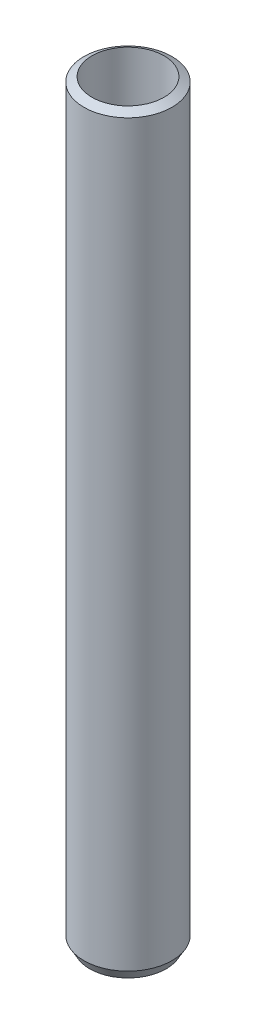
ISO-10303-21;
HEADER;
FILE_DESCRIPTION(('STEP AP214'),'2;1');
FILE_NAME('part.step','',(''),(''),'','','');
FILE_SCHEMA(('AUTOMOTIVE_DESIGN { 1 0 10303 214 1 1 1 1 }'));
ENDSEC;
DATA;
#1=APPLICATION_CONTEXT('core data for automotive mechanical design processes');
#2=APPLICATION_PROTOCOL_DEFINITION('international standard','automotive_design',2000,#1);
#3=PRODUCT_CONTEXT('',#1,'mechanical');
#4=PRODUCT('Part','Part','',(#3));
#5=PRODUCT_RELATED_PRODUCT_CATEGORY('part','',(#4));
#6=PRODUCT_DEFINITION_FORMATION('','',#4);
#7=PRODUCT_DEFINITION_CONTEXT('part definition',#1,'design');
#8=PRODUCT_DEFINITION('design','',#6,#7);
#9=PRODUCT_DEFINITION_SHAPE('','',#8);
#10=(LENGTH_UNIT() NAMED_UNIT(*) SI_UNIT(.MILLI.,.METRE.));
#11=(NAMED_UNIT(*) PLANE_ANGLE_UNIT() SI_UNIT($,.RADIAN.));
#12=(NAMED_UNIT(*) SI_UNIT($,.STERADIAN.) SOLID_ANGLE_UNIT());
#13=UNCERTAINTY_MEASURE_WITH_UNIT(LENGTH_MEASURE(1.E-05),#10,'distance_accuracy_value','');
#14=(GEOMETRIC_REPRESENTATION_CONTEXT(3) GLOBAL_UNCERTAINTY_ASSIGNED_CONTEXT((#13)) GLOBAL_UNIT_ASSIGNED_CONTEXT((#10,
#11,#12)) REPRESENTATION_CONTEXT('',''));
#15=CARTESIAN_POINT('',(0.,0.,0.));
#16=DIRECTION('',(0.,0.,1.));
#17=DIRECTION('',(1.,0.,0.));
#18=AXIS2_PLACEMENT_3D('',#15,#16,#17);
#19=CARTESIAN_POINT('',(0.,600.,0.));
#20=DIRECTION('',(0.,-1.,0.));
#21=DIRECTION('',(0.,0.,-1.));
#22=AXIS2_PLACEMENT_3D('',#19,#20,#21);
#23=CYLINDRICAL_SURFACE('',#22,35.);
#24=CARTESIAN_POINT('',(0.,595.404724764818,0.));
#25=DIRECTION('',(0.,1.,0.));
#26=DIRECTION('',(0.,0.,1.));
#27=AXIS2_PLACEMENT_3D('',#24,#25,#26);
#28=CIRCLE('',#27,35.);
#29=CARTESIAN_POINT('',(0.,595.404724764818,35.));
#30=VERTEX_POINT('',#29);
#31=EDGE_CURVE('E50',#30,#30,#28,.F.);
#32=ORIENTED_EDGE('',*,*,#31,.T.);
#33=EDGE_LOOP('',(#32));
#34=FACE_BOUND('',#33,.T.);
#35=CARTESIAN_POINT('',(0.,7.95925018209798,0.));
#36=DIRECTION('',(0.,1.,0.));
#37=DIRECTION('',(0.,0.,1.));
#38=AXIS2_PLACEMENT_3D('',#35,#36,#37);
#39=CIRCLE('',#38,35.);
#40=CARTESIAN_POINT('',(0.,7.95925018209798,35.));
#41=VERTEX_POINT('',#40);
#42=EDGE_CURVE('E51',#41,#41,#39,.T.);
#43=ORIENTED_EDGE('',*,*,#42,.T.);
#44=EDGE_LOOP('',(#43));
#45=FACE_BOUND('',#44,.T.);
#46=ADVANCED_FACE('F39',(#34,#45),#23,.T.);
#47=CARTESIAN_POINT('',(0.,0.,0.));
#48=DIRECTION('',(0.,1.,0.));
#49=DIRECTION('',(0.,0.,1.));
#50=AXIS2_PLACEMENT_3D('',#47,#48,#49);
#51=PLANE('',#50);
#52=CARTESIAN_POINT('',(0.,0.,0.));
#53=DIRECTION('',(0.,1.,0.));
#54=DIRECTION('',(0.,0.,1.));
#55=AXIS2_PLACEMENT_3D('',#52,#53,#54);
#56=CIRCLE('',#55,30.4047247648181);
#57=CARTESIAN_POINT('',(0.,0.,30.4047247648181));
#58=VERTEX_POINT('',#57);
#59=EDGE_CURVE('E10',#58,#58,#56,.F.);
#60=ORIENTED_EDGE('',*,*,#59,.T.);
#61=EDGE_LOOP('',(#60));
#62=FACE_BOUND('',#61,.T.);
#63=CARTESIAN_POINT('',(0.,0.,0.));
#64=DIRECTION('',(0.,1.,0.));
#65=DIRECTION('',(0.,0.,1.));
#66=AXIS2_PLACEMENT_3D('',#63,#64,#65);
#67=CIRCLE('',#66,28.6271371471436);
#68=CARTESIAN_POINT('',(0.,0.,28.6271371471436));
#69=VERTEX_POINT('',#68);
#70=EDGE_CURVE('E58',#69,#69,#67,.T.);
#71=ORIENTED_EDGE('',*,*,#70,.T.);
#72=EDGE_LOOP('',(#71));
#73=FACE_BOUND('',#72,.T.);
#74=ADVANCED_FACE('F62',(#62,#73),#51,.F.);
#75=CARTESIAN_POINT('',(0.,600.,0.));
#76=DIRECTION('',(0.,-1.,0.));
#77=DIRECTION('',(0.,0.,-1.));
#78=AXIS2_PLACEMENT_3D('',#75,#76,#77);
#79=CYLINDRICAL_SURFACE('',#78,28.6271371471436);
#80=CARTESIAN_POINT('',(0.,599.084098848423,0.));
#81=DIRECTION('',(0.,-1.,0.));
#82=DIRECTION('',(0.,0.,-1.));
#83=AXIS2_PLACEMENT_3D('',#80,#81,#82);
#84=CIRCLE('',#83,28.6271371471436);
#85=CARTESIAN_POINT('',(0.,599.084098848423,-28.6271371471436));
#86=VERTEX_POINT('',#85);
#87=EDGE_CURVE('E54',#86,#86,#84,.F.);
#88=ORIENTED_EDGE('',*,*,#87,.T.);
#89=EDGE_LOOP('',(#88));
#90=FACE_BOUND('',#89,.T.);
#91=ORIENTED_EDGE('',*,*,#70,.F.);
#92=EDGE_LOOP('',(#91));
#93=FACE_BOUND('',#92,.T.);
#94=ADVANCED_FACE('F68',(#90,#93),#79,.F.);
#95=CARTESIAN_POINT('',(0.,600.,0.));
#96=DIRECTION('',(0.,-1.,0.));
#97=DIRECTION('',(0.,0.,-1.));
#98=AXIS2_PLACEMENT_3D('',#95,#96,#97);
#99=CONICAL_SURFACE('',#98,27.0407498179017,1.0471975511966);
#100=ORIENTED_EDGE('',*,*,#31,.F.);
#101=EDGE_LOOP('',(#100));
#102=FACE_BOUND('',#101,.T.);
#103=ORIENTED_EDGE('',*,*,#87,.F.);
#104=EDGE_LOOP('',(#103));
#105=FACE_BOUND('',#104,.T.);
#106=ADVANCED_FACE('F66',(#102,#105),#99,.T.);
#107=CARTESIAN_POINT('',(0.,7.95925018209798,0.));
#108=DIRECTION('',(0.,1.,0.));
#109=DIRECTION('',(0.,0.,1.));
#110=AXIS2_PLACEMENT_3D('',#107,#108,#109);
#111=CONICAL_SURFACE('',#110,35.,0.523598775598306);
#112=ORIENTED_EDGE('',*,*,#59,.F.);
#113=EDGE_LOOP('',(#112));
#114=FACE_BOUND('',#113,.T.);
#115=ORIENTED_EDGE('',*,*,#42,.F.);
#116=EDGE_LOOP('',(#115));
#117=FACE_BOUND('',#116,.T.);
#118=ADVANCED_FACE('F45',(#114,#117),#111,.T.);
#119=CLOSED_SHELL('',(#46,#74,#94,#106,#118));
#120=MANIFOLD_SOLID_BREP('B2',#119);
#121=ADVANCED_BREP_SHAPE_REPRESENTATION('',(#18,#120),#14);
#122=SHAPE_DEFINITION_REPRESENTATION(#9,#121);
ENDSEC;
END-ISO-10303-21;
